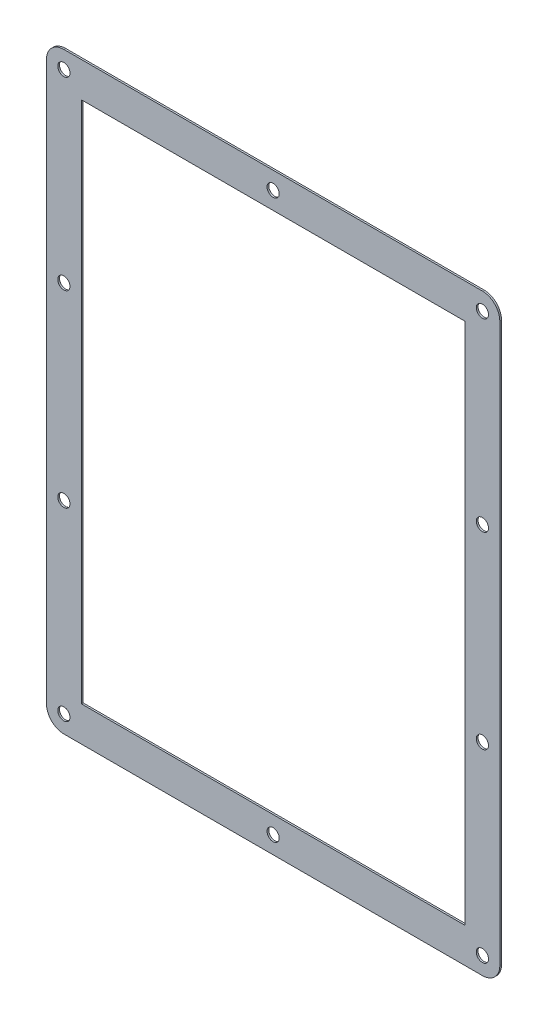
ISO-10303-21;
HEADER;
FILE_DESCRIPTION(('STEP AP214'),'2;1');
FILE_NAME('part.step','',(''),(''),'','','');
FILE_SCHEMA(('AUTOMOTIVE_DESIGN { 1 0 10303 214 1 1 1 1 }'));
ENDSEC;
DATA;
#1=APPLICATION_CONTEXT('core data for automotive mechanical design processes');
#2=APPLICATION_PROTOCOL_DEFINITION('international standard','automotive_design',2000,#1);
#3=PRODUCT_CONTEXT('',#1,'mechanical');
#4=PRODUCT('Part','Part','',(#3));
#5=PRODUCT_RELATED_PRODUCT_CATEGORY('part','',(#4));
#6=PRODUCT_DEFINITION_FORMATION('','',#4);
#7=PRODUCT_DEFINITION_CONTEXT('part definition',#1,'design');
#8=PRODUCT_DEFINITION('design','',#6,#7);
#9=PRODUCT_DEFINITION_SHAPE('','',#8);
#10=(LENGTH_UNIT() NAMED_UNIT(*) SI_UNIT(.MILLI.,.METRE.));
#11=(NAMED_UNIT(*) PLANE_ANGLE_UNIT() SI_UNIT($,.RADIAN.));
#12=(NAMED_UNIT(*) SI_UNIT($,.STERADIAN.) SOLID_ANGLE_UNIT());
#13=UNCERTAINTY_MEASURE_WITH_UNIT(LENGTH_MEASURE(1.E-05),#10,'distance_accuracy_value','');
#14=(GEOMETRIC_REPRESENTATION_CONTEXT(3) GLOBAL_UNCERTAINTY_ASSIGNED_CONTEXT((#13)) GLOBAL_UNIT_ASSIGNED_CONTEXT((#10,
#11,#12)) REPRESENTATION_CONTEXT('',''));
#15=CARTESIAN_POINT('',(0.,0.,0.));
#16=DIRECTION('',(0.,0.,1.));
#17=DIRECTION('',(1.,0.,0.));
#18=AXIS2_PLACEMENT_3D('',#15,#16,#17);
#19=CARTESIAN_POINT('',(60.,-80.,0.5));
#20=DIRECTION('',(0.,0.,1.));
#21=DIRECTION('',(1.,0.,0.));
#22=AXIS2_PLACEMENT_3D('',#19,#20,#21);
#23=PLANE('',#22);
#24=CARTESIAN_POINT('',(-60.,27.,0.5));
#25=DIRECTION('',(0.,0.,1.));
#26=DIRECTION('',(1.,0.,0.));
#27=AXIS2_PLACEMENT_3D('',#24,#25,#26);
#28=CIRCLE('',#27,1.74999999999998);
#29=CARTESIAN_POINT('',(-58.25,27.,0.5));
#30=VERTEX_POINT('',#29);
#31=EDGE_CURVE('E347',#30,#30,#28,.T.);
#32=ORIENTED_EDGE('',*,*,#31,.F.);
#33=EDGE_LOOP('',(#32));
#34=FACE_BOUND('',#33,.T.);
#35=CARTESIAN_POINT('',(60.,80.,0.5));
#36=DIRECTION('',(0.,0.,1.));
#37=DIRECTION('',(-1.,0.,0.));
#38=AXIS2_PLACEMENT_3D('',#35,#36,#37);
#39=CIRCLE('',#38,1.75000000000004);
#40=CARTESIAN_POINT('',(58.25,80.,0.5));
#41=VERTEX_POINT('',#40);
#42=EDGE_CURVE('E359',#41,#41,#39,.T.);
#43=ORIENTED_EDGE('',*,*,#42,.F.);
#44=EDGE_LOOP('',(#43));
#45=FACE_BOUND('',#44,.T.);
#46=CARTESIAN_POINT('',(0.,-79.9999999999999,0.5));
#47=DIRECTION('',(0.,0.,1.));
#48=DIRECTION('',(1.,0.,0.));
#49=AXIS2_PLACEMENT_3D('',#46,#47,#48);
#50=CIRCLE('',#49,1.75000000000001);
#51=CARTESIAN_POINT('',(1.75000000000001,-79.9999999999999,0.5));
#52=VERTEX_POINT('',#51);
#53=EDGE_CURVE('E371',#52,#52,#50,.T.);
#54=ORIENTED_EDGE('',*,*,#53,.F.);
#55=EDGE_LOOP('',(#54));
#56=FACE_BOUND('',#55,.T.);
#57=CARTESIAN_POINT('',(-60.,-27.,0.5));
#58=DIRECTION('',(0.,0.,1.));
#59=DIRECTION('',(-1.,0.,0.));
#60=AXIS2_PLACEMENT_3D('',#57,#58,#59);
#61=CIRCLE('',#60,1.74999999999998);
#62=CARTESIAN_POINT('',(-61.75,-27.,0.5));
#63=VERTEX_POINT('',#62);
#64=EDGE_CURVE('E383',#63,#63,#61,.T.);
#65=ORIENTED_EDGE('',*,*,#64,.F.);
#66=EDGE_LOOP('',(#65));
#67=FACE_BOUND('',#66,.T.);
#68=CARTESIAN_POINT('',(60.,-27.,0.5));
#69=DIRECTION('',(0.,0.,1.));
#70=DIRECTION('',(1.,0.,0.));
#71=AXIS2_PLACEMENT_3D('',#68,#69,#70);
#72=CIRCLE('',#71,1.75000000000004);
#73=CARTESIAN_POINT('',(61.75,-27.,0.5));
#74=VERTEX_POINT('',#73);
#75=EDGE_CURVE('E155',#74,#74,#72,.T.);
#76=ORIENTED_EDGE('',*,*,#75,.F.);
#77=EDGE_LOOP('',(#76));
#78=FACE_BOUND('',#77,.T.);
#79=CARTESIAN_POINT('',(60.,-80.,0.5));
#80=DIRECTION('',(0.,0.,1.));
#81=DIRECTION('',(1.,0.,0.));
#82=AXIS2_PLACEMENT_3D('',#79,#80,#81);
#83=CIRCLE('',#82,5.00000000000002);
#84=CARTESIAN_POINT('',(60.,-85.,0.5));
#85=VERTEX_POINT('',#84);
#86=CARTESIAN_POINT('',(65.,-80.,0.5));
#87=VERTEX_POINT('',#86);
#88=EDGE_CURVE('E165',#85,#87,#83,.T.);
#89=ORIENTED_EDGE('',*,*,#88,.T.);
#90=DIRECTION('',(0.,1.,0.));
#91=VECTOR('',#90,1.);
#92=CARTESIAN_POINT('',(65.,-80.,0.5));
#93=LINE('',#92,#91);
#94=CARTESIAN_POINT('',(65.,79.9999999999999,0.5));
#95=VERTEX_POINT('',#94);
#96=EDGE_CURVE('E168',#87,#95,#93,.T.);
#97=ORIENTED_EDGE('',*,*,#96,.T.);
#98=CARTESIAN_POINT('',(60.,79.9999999999999,0.5));
#99=DIRECTION('',(0.,0.,1.));
#100=DIRECTION('',(1.,0.,0.));
#101=AXIS2_PLACEMENT_3D('',#98,#99,#100);
#102=CIRCLE('',#101,5.00000000000002);
#103=CARTESIAN_POINT('',(60.,85.,0.5));
#104=VERTEX_POINT('',#103);
#105=EDGE_CURVE('E171',#95,#104,#102,.T.);
#106=ORIENTED_EDGE('',*,*,#105,.T.);
#107=DIRECTION('',(-1.,0.,0.));
#108=VECTOR('',#107,1.);
#109=CARTESIAN_POINT('',(60.,85.,0.5));
#110=LINE('',#109,#108);
#111=CARTESIAN_POINT('',(-60.0000000000001,85.,0.5));
#112=VERTEX_POINT('',#111);
#113=EDGE_CURVE('E173',#104,#112,#110,.T.);
#114=ORIENTED_EDGE('',*,*,#113,.T.);
#115=CARTESIAN_POINT('',(-60.0000000000001,79.9999999999999,0.5));
#116=DIRECTION('',(0.,0.,1.));
#117=DIRECTION('',(1.,0.,0.));
#118=AXIS2_PLACEMENT_3D('',#115,#116,#117);
#119=CIRCLE('',#118,5.00000000000001);
#120=CARTESIAN_POINT('',(-65.0000000000001,79.9999999999999,0.5));
#121=VERTEX_POINT('',#120);
#122=EDGE_CURVE('E175',#112,#121,#119,.T.);
#123=ORIENTED_EDGE('',*,*,#122,.T.);
#124=DIRECTION('',(0.,-1.,0.));
#125=VECTOR('',#124,1.);
#126=CARTESIAN_POINT('',(-65.0000000000001,-80.,0.5));
#127=LINE('',#126,#125);
#128=CARTESIAN_POINT('',(-65.0000000000001,-80.,0.5));
#129=VERTEX_POINT('',#128);
#130=EDGE_CURVE('E177',#121,#129,#127,.T.);
#131=ORIENTED_EDGE('',*,*,#130,.T.);
#132=CARTESIAN_POINT('',(-60.0000000000001,-80.,0.5));
#133=DIRECTION('',(0.,0.,1.));
#134=DIRECTION('',(-1.,0.,0.));
#135=AXIS2_PLACEMENT_3D('',#132,#133,#134);
#136=CIRCLE('',#135,5.);
#137=CARTESIAN_POINT('',(-60.0000000000001,-85.,0.5));
#138=VERTEX_POINT('',#137);
#139=EDGE_CURVE('E179',#129,#138,#136,.T.);
#140=ORIENTED_EDGE('',*,*,#139,.T.);
#141=DIRECTION('',(1.,0.,0.));
#142=VECTOR('',#141,1.);
#143=CARTESIAN_POINT('',(60.,-85.,0.5));
#144=LINE('',#143,#142);
#145=EDGE_CURVE('E181',#138,#85,#144,.T.);
#146=ORIENTED_EDGE('',*,*,#145,.T.);
#147=EDGE_LOOP('',(#89,#97,#106,#114,#123,#131,#140,#146));
#148=FACE_BOUND('',#147,.T.);
#149=DIRECTION('',(0.,1.,0.));
#150=VECTOR('',#149,1.);
#151=CARTESIAN_POINT('',(55.,-75.,0.5));
#152=LINE('',#151,#150);
#153=CARTESIAN_POINT('',(55.,-75.,0.5));
#154=VERTEX_POINT('',#153);
#155=CARTESIAN_POINT('',(55.,75.,0.5));
#156=VERTEX_POINT('',#155);
#157=EDGE_CURVE('E134',#154,#156,#152,.T.);
#158=ORIENTED_EDGE('',*,*,#157,.F.);
#159=DIRECTION('',(1.,0.,0.));
#160=VECTOR('',#159,1.);
#161=CARTESIAN_POINT('',(55.,-75.,0.5));
#162=LINE('',#161,#160);
#163=CARTESIAN_POINT('',(-55.0000000000001,-75.,0.5));
#164=VERTEX_POINT('',#163);
#165=EDGE_CURVE('E126',#164,#154,#162,.T.);
#166=ORIENTED_EDGE('',*,*,#165,.F.);
#167=DIRECTION('',(0.,-1.,0.));
#168=VECTOR('',#167,1.);
#169=CARTESIAN_POINT('',(-55.0000000000001,-75.,0.5));
#170=LINE('',#169,#168);
#171=CARTESIAN_POINT('',(-55.0000000000001,75.,0.5));
#172=VERTEX_POINT('',#171);
#173=EDGE_CURVE('E149',#172,#164,#170,.T.);
#174=ORIENTED_EDGE('',*,*,#173,.F.);
#175=DIRECTION('',(-1.,0.,0.));
#176=VECTOR('',#175,1.);
#177=CARTESIAN_POINT('',(55.,75.,0.5));
#178=LINE('',#177,#176);
#179=EDGE_CURVE('E147',#156,#172,#178,.T.);
#180=ORIENTED_EDGE('',*,*,#179,.F.);
#181=EDGE_LOOP('',(#158,#166,#174,#180));
#182=FACE_BOUND('',#181,.T.);
#183=CARTESIAN_POINT('',(60.,-79.9999999999999,0.5));
#184=DIRECTION('',(0.,0.,1.));
#185=DIRECTION('',(1.,0.,0.));
#186=AXIS2_PLACEMENT_3D('',#183,#184,#185);
#187=CIRCLE('',#186,1.75000000000004);
#188=CARTESIAN_POINT('',(61.75,-79.9999999999999,0.5));
#189=VERTEX_POINT('',#188);
#190=EDGE_CURVE('E389',#189,#189,#187,.T.);
#191=ORIENTED_EDGE('',*,*,#190,.F.);
#192=EDGE_LOOP('',(#191));
#193=FACE_BOUND('',#192,.T.);
#194=CARTESIAN_POINT('',(-60.,-79.9999999999999,0.5));
#195=DIRECTION('',(0.,0.,1.));
#196=DIRECTION('',(-1.,0.,0.));
#197=AXIS2_PLACEMENT_3D('',#194,#195,#196);
#198=CIRCLE('',#197,1.74999999999998);
#199=CARTESIAN_POINT('',(-61.75,-79.9999999999999,0.5));
#200=VERTEX_POINT('',#199);
#201=EDGE_CURVE('E377',#200,#200,#198,.T.);
#202=ORIENTED_EDGE('',*,*,#201,.F.);
#203=EDGE_LOOP('',(#202));
#204=FACE_BOUND('',#203,.T.);
#205=CARTESIAN_POINT('',(60.,27.,0.5));
#206=DIRECTION('',(0.,0.,1.));
#207=DIRECTION('',(-1.,0.,0.));
#208=AXIS2_PLACEMENT_3D('',#205,#206,#207);
#209=CIRCLE('',#208,1.75000000000004);
#210=CARTESIAN_POINT('',(58.25,27.,0.5));
#211=VERTEX_POINT('',#210);
#212=EDGE_CURVE('E365',#211,#211,#209,.T.);
#213=ORIENTED_EDGE('',*,*,#212,.F.);
#214=EDGE_LOOP('',(#213));
#215=FACE_BOUND('',#214,.T.);
#216=CARTESIAN_POINT('',(0.,80.,0.5));
#217=DIRECTION('',(0.,0.,1.));
#218=DIRECTION('',(-1.,0.,0.));
#219=AXIS2_PLACEMENT_3D('',#216,#217,#218);
#220=CIRCLE('',#219,1.75000000000001);
#221=CARTESIAN_POINT('',(-1.75000000000001,80.,0.5));
#222=VERTEX_POINT('',#221);
#223=EDGE_CURVE('E353',#222,#222,#220,.T.);
#224=ORIENTED_EDGE('',*,*,#223,.F.);
#225=EDGE_LOOP('',(#224));
#226=FACE_BOUND('',#225,.T.);
#227=CARTESIAN_POINT('',(-60.,80.,0.5));
#228=DIRECTION('',(0.,0.,1.));
#229=DIRECTION('',(1.,0.,0.));
#230=AXIS2_PLACEMENT_3D('',#227,#228,#229);
#231=CIRCLE('',#230,1.74999999999998);
#232=CARTESIAN_POINT('',(-58.25,80.,0.5));
#233=VERTEX_POINT('',#232);
#234=EDGE_CURVE('E338',#233,#233,#231,.T.);
#235=ORIENTED_EDGE('',*,*,#234,.F.);
#236=EDGE_LOOP('',(#235));
#237=FACE_BOUND('',#236,.T.);
#238=ADVANCED_FACE('F37',(#34,#45,#56,#67,#78,#148,#182,#193,#204,#215,#226,#237),#23,.T.);
#239=CARTESIAN_POINT('',(60.,-80.,0.));
#240=DIRECTION('',(0.,0.,1.));
#241=DIRECTION('',(1.,0.,0.));
#242=AXIS2_PLACEMENT_3D('',#239,#240,#241);
#243=PLANE('',#242);
#244=CARTESIAN_POINT('',(60.,-80.,0.));
#245=DIRECTION('',(0.,0.,1.));
#246=DIRECTION('',(1.,0.,0.));
#247=AXIS2_PLACEMENT_3D('',#244,#245,#246);
#248=CIRCLE('',#247,5.00000000000002);
#249=CARTESIAN_POINT('',(60.,-85.,0.));
#250=VERTEX_POINT('',#249);
#251=CARTESIAN_POINT('',(65.,-80.,0.));
#252=VERTEX_POINT('',#251);
#253=EDGE_CURVE('E142',#250,#252,#248,.T.);
#254=ORIENTED_EDGE('',*,*,#253,.F.);
#255=DIRECTION('',(1.,0.,0.));
#256=VECTOR('',#255,1.);
#257=CARTESIAN_POINT('',(60.,-85.,0.));
#258=LINE('',#257,#256);
#259=CARTESIAN_POINT('',(-60.0000000000001,-85.,0.));
#260=VERTEX_POINT('',#259);
#261=EDGE_CURVE('E169',#260,#250,#258,.T.);
#262=ORIENTED_EDGE('',*,*,#261,.F.);
#263=CARTESIAN_POINT('',(-60.0000000000001,-80.,0.));
#264=DIRECTION('',(0.,0.,1.));
#265=DIRECTION('',(-1.,0.,0.));
#266=AXIS2_PLACEMENT_3D('',#263,#264,#265);
#267=CIRCLE('',#266,5.);
#268=CARTESIAN_POINT('',(-65.0000000000001,-80.,0.));
#269=VERTEX_POINT('',#268);
#270=EDGE_CURVE('E196',#269,#260,#267,.T.);
#271=ORIENTED_EDGE('',*,*,#270,.F.);
#272=DIRECTION('',(0.,-1.,0.));
#273=VECTOR('',#272,1.);
#274=CARTESIAN_POINT('',(-65.0000000000001,-80.,0.));
#275=LINE('',#274,#273);
#276=CARTESIAN_POINT('',(-65.0000000000001,79.9999999999999,0.));
#277=VERTEX_POINT('',#276);
#278=EDGE_CURVE('E194',#277,#269,#275,.T.);
#279=ORIENTED_EDGE('',*,*,#278,.F.);
#280=CARTESIAN_POINT('',(-60.0000000000001,79.9999999999999,0.));
#281=DIRECTION('',(0.,0.,1.));
#282=DIRECTION('',(1.,0.,0.));
#283=AXIS2_PLACEMENT_3D('',#280,#281,#282);
#284=CIRCLE('',#283,5.00000000000001);
#285=CARTESIAN_POINT('',(-60.0000000000001,85.,0.));
#286=VERTEX_POINT('',#285);
#287=EDGE_CURVE('E192',#286,#277,#284,.T.);
#288=ORIENTED_EDGE('',*,*,#287,.F.);
#289=DIRECTION('',(-1.,0.,0.));
#290=VECTOR('',#289,1.);
#291=CARTESIAN_POINT('',(60.,85.,0.));
#292=LINE('',#291,#290);
#293=CARTESIAN_POINT('',(60.,85.,0.));
#294=VERTEX_POINT('',#293);
#295=EDGE_CURVE('E190',#294,#286,#292,.T.);
#296=ORIENTED_EDGE('',*,*,#295,.F.);
#297=CARTESIAN_POINT('',(60.,79.9999999999999,0.));
#298=DIRECTION('',(0.,0.,1.));
#299=DIRECTION('',(1.,0.,0.));
#300=AXIS2_PLACEMENT_3D('',#297,#298,#299);
#301=CIRCLE('',#300,5.00000000000002);
#302=CARTESIAN_POINT('',(65.,79.9999999999999,0.));
#303=VERTEX_POINT('',#302);
#304=EDGE_CURVE('E188',#303,#294,#301,.T.);
#305=ORIENTED_EDGE('',*,*,#304,.F.);
#306=DIRECTION('',(0.,1.,0.));
#307=VECTOR('',#306,1.);
#308=CARTESIAN_POINT('',(65.,-80.,0.));
#309=LINE('',#308,#307);
#310=EDGE_CURVE('E186',#252,#303,#309,.T.);
#311=ORIENTED_EDGE('',*,*,#310,.F.);
#312=EDGE_LOOP('',(#254,#262,#271,#279,#288,#296,#305,#311));
#313=FACE_BOUND('',#312,.T.);
#314=DIRECTION('',(1.,0.,0.));
#315=VECTOR('',#314,1.);
#316=CARTESIAN_POINT('',(55.,-75.,0.));
#317=LINE('',#316,#315);
#318=CARTESIAN_POINT('',(-55.0000000000001,-75.,0.));
#319=VERTEX_POINT('',#318);
#320=CARTESIAN_POINT('',(55.,-75.,0.));
#321=VERTEX_POINT('',#320);
#322=EDGE_CURVE('E60',#319,#321,#317,.T.);
#323=ORIENTED_EDGE('',*,*,#322,.T.);
#324=DIRECTION('',(0.,1.,0.));
#325=VECTOR('',#324,1.);
#326=CARTESIAN_POINT('',(55.,-75.,0.));
#327=LINE('',#326,#325);
#328=CARTESIAN_POINT('',(55.,75.,0.));
#329=VERTEX_POINT('',#328);
#330=EDGE_CURVE('E141',#321,#329,#327,.T.);
#331=ORIENTED_EDGE('',*,*,#330,.T.);
#332=DIRECTION('',(-1.,0.,0.));
#333=VECTOR('',#332,1.);
#334=CARTESIAN_POINT('',(55.,75.,0.));
#335=LINE('',#334,#333);
#336=CARTESIAN_POINT('',(-55.0000000000001,75.,0.));
#337=VERTEX_POINT('',#336);
#338=EDGE_CURVE('E157',#329,#337,#335,.T.);
#339=ORIENTED_EDGE('',*,*,#338,.T.);
#340=DIRECTION('',(0.,-1.,0.));
#341=VECTOR('',#340,1.);
#342=CARTESIAN_POINT('',(-55.0000000000001,-75.,0.));
#343=LINE('',#342,#341);
#344=EDGE_CURVE('E135',#337,#319,#343,.T.);
#345=ORIENTED_EDGE('',*,*,#344,.T.);
#346=EDGE_LOOP('',(#323,#331,#339,#345));
#347=FACE_BOUND('',#346,.T.);
#348=CARTESIAN_POINT('',(60.,-27.,0.));
#349=DIRECTION('',(0.,0.,1.));
#350=DIRECTION('',(1.,0.,0.));
#351=AXIS2_PLACEMENT_3D('',#348,#349,#350);
#352=CIRCLE('',#351,1.75000000000004);
#353=CARTESIAN_POINT('',(61.75,-27.,0.));
#354=VERTEX_POINT('',#353);
#355=EDGE_CURVE('E392',#354,#354,#352,.T.);
#356=ORIENTED_EDGE('',*,*,#355,.T.);
#357=EDGE_LOOP('',(#356));
#358=FACE_BOUND('',#357,.T.);
#359=CARTESIAN_POINT('',(60.,-79.9999999999999,0.));
#360=DIRECTION('',(0.,0.,1.));
#361=DIRECTION('',(1.,0.,0.));
#362=AXIS2_PLACEMENT_3D('',#359,#360,#361);
#363=CIRCLE('',#362,1.75000000000004);
#364=CARTESIAN_POINT('',(61.75,-79.9999999999999,0.));
#365=VERTEX_POINT('',#364);
#366=EDGE_CURVE('E386',#365,#365,#363,.T.);
#367=ORIENTED_EDGE('',*,*,#366,.T.);
#368=EDGE_LOOP('',(#367));
#369=FACE_BOUND('',#368,.T.);
#370=CARTESIAN_POINT('',(-60.,-27.,0.));
#371=DIRECTION('',(0.,0.,1.));
#372=DIRECTION('',(-1.,0.,0.));
#373=AXIS2_PLACEMENT_3D('',#370,#371,#372);
#374=CIRCLE('',#373,1.74999999999998);
#375=CARTESIAN_POINT('',(-61.75,-27.,0.));
#376=VERTEX_POINT('',#375);
#377=EDGE_CURVE('E380',#376,#376,#374,.T.);
#378=ORIENTED_EDGE('',*,*,#377,.T.);
#379=EDGE_LOOP('',(#378));
#380=FACE_BOUND('',#379,.T.);
#381=CARTESIAN_POINT('',(-60.,-79.9999999999999,0.));
#382=DIRECTION('',(0.,0.,1.));
#383=DIRECTION('',(-1.,0.,0.));
#384=AXIS2_PLACEMENT_3D('',#381,#382,#383);
#385=CIRCLE('',#384,1.74999999999998);
#386=CARTESIAN_POINT('',(-61.75,-79.9999999999999,0.));
#387=VERTEX_POINT('',#386);
#388=EDGE_CURVE('E374',#387,#387,#385,.T.);
#389=ORIENTED_EDGE('',*,*,#388,.T.);
#390=EDGE_LOOP('',(#389));
#391=FACE_BOUND('',#390,.T.);
#392=CARTESIAN_POINT('',(0.,-79.9999999999999,0.));
#393=DIRECTION('',(0.,0.,1.));
#394=DIRECTION('',(1.,0.,0.));
#395=AXIS2_PLACEMENT_3D('',#392,#393,#394);
#396=CIRCLE('',#395,1.75000000000001);
#397=CARTESIAN_POINT('',(1.75000000000001,-79.9999999999999,0.));
#398=VERTEX_POINT('',#397);
#399=EDGE_CURVE('E368',#398,#398,#396,.T.);
#400=ORIENTED_EDGE('',*,*,#399,.T.);
#401=EDGE_LOOP('',(#400));
#402=FACE_BOUND('',#401,.T.);
#403=CARTESIAN_POINT('',(60.,27.,0.));
#404=DIRECTION('',(0.,0.,1.));
#405=DIRECTION('',(-1.,0.,0.));
#406=AXIS2_PLACEMENT_3D('',#403,#404,#405);
#407=CIRCLE('',#406,1.75000000000004);
#408=CARTESIAN_POINT('',(58.25,27.,0.));
#409=VERTEX_POINT('',#408);
#410=EDGE_CURVE('E362',#409,#409,#407,.T.);
#411=ORIENTED_EDGE('',*,*,#410,.T.);
#412=EDGE_LOOP('',(#411));
#413=FACE_BOUND('',#412,.T.);
#414=CARTESIAN_POINT('',(60.,80.,0.));
#415=DIRECTION('',(0.,0.,1.));
#416=DIRECTION('',(-1.,0.,0.));
#417=AXIS2_PLACEMENT_3D('',#414,#415,#416);
#418=CIRCLE('',#417,1.75000000000004);
#419=CARTESIAN_POINT('',(58.25,80.,0.));
#420=VERTEX_POINT('',#419);
#421=EDGE_CURVE('E356',#420,#420,#418,.T.);
#422=ORIENTED_EDGE('',*,*,#421,.T.);
#423=EDGE_LOOP('',(#422));
#424=FACE_BOUND('',#423,.T.);
#425=CARTESIAN_POINT('',(0.,80.,0.));
#426=DIRECTION('',(0.,0.,1.));
#427=DIRECTION('',(-1.,0.,0.));
#428=AXIS2_PLACEMENT_3D('',#425,#426,#427);
#429=CIRCLE('',#428,1.75000000000001);
#430=CARTESIAN_POINT('',(-1.75000000000001,80.,0.));
#431=VERTEX_POINT('',#430);
#432=EDGE_CURVE('E350',#431,#431,#429,.T.);
#433=ORIENTED_EDGE('',*,*,#432,.T.);
#434=EDGE_LOOP('',(#433));
#435=FACE_BOUND('',#434,.T.);
#436=CARTESIAN_POINT('',(-60.,27.,0.));
#437=DIRECTION('',(0.,0.,1.));
#438=DIRECTION('',(1.,0.,0.));
#439=AXIS2_PLACEMENT_3D('',#436,#437,#438);
#440=CIRCLE('',#439,1.74999999999998);
#441=CARTESIAN_POINT('',(-58.25,27.,0.));
#442=VERTEX_POINT('',#441);
#443=EDGE_CURVE('E344',#442,#442,#440,.T.);
#444=ORIENTED_EDGE('',*,*,#443,.T.);
#445=EDGE_LOOP('',(#444));
#446=FACE_BOUND('',#445,.T.);
#447=CARTESIAN_POINT('',(-60.,80.,0.));
#448=DIRECTION('',(0.,0.,1.));
#449=DIRECTION('',(1.,0.,0.));
#450=AXIS2_PLACEMENT_3D('',#447,#448,#449);
#451=CIRCLE('',#450,1.74999999999998);
#452=CARTESIAN_POINT('',(-58.25,80.,0.));
#453=VERTEX_POINT('',#452);
#454=EDGE_CURVE('E341',#453,#453,#451,.T.);
#455=ORIENTED_EDGE('',*,*,#454,.T.);
#456=EDGE_LOOP('',(#455));
#457=FACE_BOUND('',#456,.T.);
#458=ADVANCED_FACE('F226',(#313,#347,#358,#369,#380,#391,#402,#413,#424,#435,#446,#457),#243,.F.);
#459=CARTESIAN_POINT('',(60.,-80.,0.5));
#460=DIRECTION('',(0.,0.,-1.));
#461=DIRECTION('',(-1.,0.,0.));
#462=AXIS2_PLACEMENT_3D('',#459,#460,#461);
#463=CYLINDRICAL_SURFACE('',#462,5.00000000000002);
#464=ORIENTED_EDGE('',*,*,#253,.T.);
#465=DIRECTION('',(0.,0.,-1.));
#466=VECTOR('',#465,1.);
#467=CARTESIAN_POINT('',(65.,-80.,0.5));
#468=LINE('',#467,#466);
#469=EDGE_CURVE('E11',#87,#252,#468,.T.);
#470=ORIENTED_EDGE('',*,*,#469,.F.);
#471=ORIENTED_EDGE('',*,*,#88,.F.);
#472=DIRECTION('',(0.,0.,-1.));
#473=VECTOR('',#472,1.);
#474=CARTESIAN_POINT('',(60.,-85.,0.5));
#475=LINE('',#474,#473);
#476=EDGE_CURVE('E183',#85,#250,#475,.T.);
#477=ORIENTED_EDGE('',*,*,#476,.T.);
#478=EDGE_LOOP('',(#464,#470,#471,#477));
#479=FACE_BOUND('',#478,.T.);
#480=ADVANCED_FACE('F39',(#479),#463,.T.);
#481=CARTESIAN_POINT('',(65.,-80.,0.5));
#482=DIRECTION('',(-1.,0.,0.));
#483=DIRECTION('',(0.,0.,1.));
#484=AXIS2_PLACEMENT_3D('',#481,#482,#483);
#485=PLANE('',#484);
#486=ORIENTED_EDGE('',*,*,#310,.T.);
#487=DIRECTION('',(0.,0.,-1.));
#488=VECTOR('',#487,1.);
#489=CARTESIAN_POINT('',(65.,79.9999999999999,0.5));
#490=LINE('',#489,#488);
#491=EDGE_CURVE('E45',#95,#303,#490,.T.);
#492=ORIENTED_EDGE('',*,*,#491,.F.);
#493=ORIENTED_EDGE('',*,*,#96,.F.);
#494=ORIENTED_EDGE('',*,*,#469,.T.);
#495=EDGE_LOOP('',(#486,#492,#493,#494));
#496=FACE_BOUND('',#495,.T.);
#497=ADVANCED_FACE('F243',(#496),#485,.F.);
#498=CARTESIAN_POINT('',(60.,79.9999999999999,0.5));
#499=DIRECTION('',(0.,0.,-1.));
#500=DIRECTION('',(-1.,0.,0.));
#501=AXIS2_PLACEMENT_3D('',#498,#499,#500);
#502=CYLINDRICAL_SURFACE('',#501,5.00000000000002);
#503=ORIENTED_EDGE('',*,*,#304,.T.);
#504=DIRECTION('',(0.,0.,-1.));
#505=VECTOR('',#504,1.);
#506=CARTESIAN_POINT('',(60.,85.,0.5));
#507=LINE('',#506,#505);
#508=EDGE_CURVE('E213',#104,#294,#507,.T.);
#509=ORIENTED_EDGE('',*,*,#508,.F.);
#510=ORIENTED_EDGE('',*,*,#105,.F.);
#511=ORIENTED_EDGE('',*,*,#491,.T.);
#512=EDGE_LOOP('',(#503,#509,#510,#511));
#513=FACE_BOUND('',#512,.T.);
#514=ADVANCED_FACE('F220',(#513),#502,.T.);
#515=CARTESIAN_POINT('',(60.,85.,0.5));
#516=DIRECTION('',(0.,-1.,0.));
#517=DIRECTION('',(0.,0.,-1.));
#518=AXIS2_PLACEMENT_3D('',#515,#516,#517);
#519=PLANE('',#518);
#520=ORIENTED_EDGE('',*,*,#295,.T.);
#521=DIRECTION('',(0.,0.,-1.));
#522=VECTOR('',#521,1.);
#523=CARTESIAN_POINT('',(-60.0000000000001,85.,0.5));
#524=LINE('',#523,#522);
#525=EDGE_CURVE('E210',#112,#286,#524,.T.);
#526=ORIENTED_EDGE('',*,*,#525,.F.);
#527=ORIENTED_EDGE('',*,*,#113,.F.);
#528=ORIENTED_EDGE('',*,*,#508,.T.);
#529=EDGE_LOOP('',(#520,#526,#527,#528));
#530=FACE_BOUND('',#529,.T.);
#531=ADVANCED_FACE('F232',(#530),#519,.F.);
#532=CARTESIAN_POINT('',(-60.0000000000001,79.9999999999999,0.5));
#533=DIRECTION('',(0.,0.,-1.));
#534=DIRECTION('',(-1.,0.,0.));
#535=AXIS2_PLACEMENT_3D('',#532,#533,#534);
#536=CYLINDRICAL_SURFACE('',#535,5.00000000000001);
#537=ORIENTED_EDGE('',*,*,#287,.T.);
#538=DIRECTION('',(0.,0.,-1.));
#539=VECTOR('',#538,1.);
#540=CARTESIAN_POINT('',(-65.0000000000001,79.9999999999999,0.5));
#541=LINE('',#540,#539);
#542=EDGE_CURVE('E207',#121,#277,#541,.T.);
#543=ORIENTED_EDGE('',*,*,#542,.F.);
#544=ORIENTED_EDGE('',*,*,#122,.F.);
#545=ORIENTED_EDGE('',*,*,#525,.T.);
#546=EDGE_LOOP('',(#537,#543,#544,#545));
#547=FACE_BOUND('',#546,.T.);
#548=ADVANCED_FACE('F236',(#547),#536,.T.);
#549=CARTESIAN_POINT('',(-65.0000000000001,-80.,0.5));
#550=DIRECTION('',(1.,0.,0.));
#551=DIRECTION('',(0.,1.,0.));
#552=AXIS2_PLACEMENT_3D('',#549,#550,#551);
#553=PLANE('',#552);
#554=ORIENTED_EDGE('',*,*,#278,.T.);
#555=DIRECTION('',(0.,0.,-1.));
#556=VECTOR('',#555,1.);
#557=CARTESIAN_POINT('',(-65.0000000000001,-80.,0.5));
#558=LINE('',#557,#556);
#559=EDGE_CURVE('E204',#129,#269,#558,.T.);
#560=ORIENTED_EDGE('',*,*,#559,.F.);
#561=ORIENTED_EDGE('',*,*,#130,.F.);
#562=ORIENTED_EDGE('',*,*,#542,.T.);
#563=EDGE_LOOP('',(#554,#560,#561,#562));
#564=FACE_BOUND('',#563,.T.);
#565=ADVANCED_FACE('F256',(#564),#553,.F.);
#566=CARTESIAN_POINT('',(-60.0000000000001,-80.,0.5));
#567=DIRECTION('',(0.,0.,-1.));
#568=DIRECTION('',(-1.,0.,0.));
#569=AXIS2_PLACEMENT_3D('',#566,#567,#568);
#570=CYLINDRICAL_SURFACE('',#569,5.);
#571=ORIENTED_EDGE('',*,*,#270,.T.);
#572=DIRECTION('',(0.,0.,-1.));
#573=VECTOR('',#572,1.);
#574=CARTESIAN_POINT('',(-60.0000000000001,-85.,0.5));
#575=LINE('',#574,#573);
#576=EDGE_CURVE('E201',#138,#260,#575,.T.);
#577=ORIENTED_EDGE('',*,*,#576,.F.);
#578=ORIENTED_EDGE('',*,*,#139,.F.);
#579=ORIENTED_EDGE('',*,*,#559,.T.);
#580=EDGE_LOOP('',(#571,#577,#578,#579));
#581=FACE_BOUND('',#580,.T.);
#582=ADVANCED_FACE('F254',(#581),#570,.T.);
#583=CARTESIAN_POINT('',(60.,-85.,0.5));
#584=DIRECTION('',(0.,1.,0.));
#585=DIRECTION('',(-1.,0.,0.));
#586=AXIS2_PLACEMENT_3D('',#583,#584,#585);
#587=PLANE('',#586);
#588=ORIENTED_EDGE('',*,*,#261,.T.);
#589=ORIENTED_EDGE('',*,*,#476,.F.);
#590=ORIENTED_EDGE('',*,*,#145,.F.);
#591=ORIENTED_EDGE('',*,*,#576,.T.);
#592=EDGE_LOOP('',(#588,#589,#590,#591));
#593=FACE_BOUND('',#592,.T.);
#594=ADVANCED_FACE('F249',(#593),#587,.F.);
#595=CARTESIAN_POINT('',(55.,-75.,0.5));
#596=DIRECTION('',(0.,1.,0.));
#597=DIRECTION('',(-1.,0.,0.));
#598=AXIS2_PLACEMENT_3D('',#595,#596,#597);
#599=PLANE('',#598);
#600=ORIENTED_EDGE('',*,*,#322,.F.);
#601=DIRECTION('',(0.,0.,-1.));
#602=VECTOR('',#601,1.);
#603=CARTESIAN_POINT('',(-55.0000000000001,-75.,0.5));
#604=LINE('',#603,#602);
#605=EDGE_CURVE('E130',#164,#319,#604,.T.);
#606=ORIENTED_EDGE('',*,*,#605,.F.);
#607=ORIENTED_EDGE('',*,*,#165,.T.);
#608=DIRECTION('',(0.,0.,-1.));
#609=VECTOR('',#608,1.);
#610=CARTESIAN_POINT('',(55.,-75.,0.5));
#611=LINE('',#610,#609);
#612=EDGE_CURVE('E129',#154,#321,#611,.T.);
#613=ORIENTED_EDGE('',*,*,#612,.T.);
#614=EDGE_LOOP('',(#600,#606,#607,#613));
#615=FACE_BOUND('',#614,.T.);
#616=ADVANCED_FACE('F128',(#615),#599,.T.);
#617=CARTESIAN_POINT('',(55.,-75.,0.5));
#618=DIRECTION('',(-1.,0.,0.));
#619=DIRECTION('',(0.,0.,1.));
#620=AXIS2_PLACEMENT_3D('',#617,#618,#619);
#621=PLANE('',#620);
#622=ORIENTED_EDGE('',*,*,#330,.F.);
#623=ORIENTED_EDGE('',*,*,#612,.F.);
#624=ORIENTED_EDGE('',*,*,#157,.T.);
#625=DIRECTION('',(0.,0.,-1.));
#626=VECTOR('',#625,1.);
#627=CARTESIAN_POINT('',(55.,75.,0.5));
#628=LINE('',#627,#626);
#629=EDGE_CURVE('E143',#156,#329,#628,.T.);
#630=ORIENTED_EDGE('',*,*,#629,.T.);
#631=EDGE_LOOP('',(#622,#623,#624,#630));
#632=FACE_BOUND('',#631,.T.);
#633=ADVANCED_FACE('F138',(#632),#621,.T.);
#634=CARTESIAN_POINT('',(55.,75.,0.5));
#635=DIRECTION('',(0.,-1.,0.));
#636=DIRECTION('',(0.,0.,-1.));
#637=AXIS2_PLACEMENT_3D('',#634,#635,#636);
#638=PLANE('',#637);
#639=ORIENTED_EDGE('',*,*,#338,.F.);
#640=ORIENTED_EDGE('',*,*,#629,.F.);
#641=ORIENTED_EDGE('',*,*,#179,.T.);
#642=DIRECTION('',(0.,0.,-1.));
#643=VECTOR('',#642,1.);
#644=CARTESIAN_POINT('',(-55.0000000000001,75.,0.5));
#645=LINE('',#644,#643);
#646=EDGE_CURVE('E52',#172,#337,#645,.T.);
#647=ORIENTED_EDGE('',*,*,#646,.T.);
#648=EDGE_LOOP('',(#639,#640,#641,#647));
#649=FACE_BOUND('',#648,.T.);
#650=ADVANCED_FACE('F284',(#649),#638,.T.);
#651=CARTESIAN_POINT('',(-55.0000000000001,-75.,0.5));
#652=DIRECTION('',(1.,0.,0.));
#653=DIRECTION('',(0.,1.,0.));
#654=AXIS2_PLACEMENT_3D('',#651,#652,#653);
#655=PLANE('',#654);
#656=ORIENTED_EDGE('',*,*,#344,.F.);
#657=ORIENTED_EDGE('',*,*,#646,.F.);
#658=ORIENTED_EDGE('',*,*,#173,.T.);
#659=ORIENTED_EDGE('',*,*,#605,.T.);
#660=EDGE_LOOP('',(#656,#657,#658,#659));
#661=FACE_BOUND('',#660,.T.);
#662=ADVANCED_FACE('F288',(#661),#655,.T.);
#663=CARTESIAN_POINT('',(60.,-27.,0.5));
#664=DIRECTION('',(0.,0.,-1.));
#665=DIRECTION('',(-1.,0.,0.));
#666=AXIS2_PLACEMENT_3D('',#663,#664,#665);
#667=CYLINDRICAL_SURFACE('',#666,1.75000000000004);
#668=ORIENTED_EDGE('',*,*,#75,.T.);
#669=EDGE_LOOP('',(#668));
#670=FACE_BOUND('',#669,.T.);
#671=ORIENTED_EDGE('',*,*,#355,.F.);
#672=EDGE_LOOP('',(#671));
#673=FACE_BOUND('',#672,.T.);
#674=ADVANCED_FACE('F294',(#670,#673),#667,.F.);
#675=CARTESIAN_POINT('',(60.,-79.9999999999999,0.5));
#676=DIRECTION('',(0.,0.,-1.));
#677=DIRECTION('',(-1.,0.,0.));
#678=AXIS2_PLACEMENT_3D('',#675,#676,#677);
#679=CYLINDRICAL_SURFACE('',#678,1.75000000000004);
#680=ORIENTED_EDGE('',*,*,#190,.T.);
#681=EDGE_LOOP('',(#680));
#682=FACE_BOUND('',#681,.T.);
#683=ORIENTED_EDGE('',*,*,#366,.F.);
#684=EDGE_LOOP('',(#683));
#685=FACE_BOUND('',#684,.T.);
#686=ADVANCED_FACE('F297',(#682,#685),#679,.F.);
#687=CARTESIAN_POINT('',(-60.,-27.,0.5));
#688=DIRECTION('',(0.,0.,-1.));
#689=DIRECTION('',(-1.,0.,0.));
#690=AXIS2_PLACEMENT_3D('',#687,#688,#689);
#691=CYLINDRICAL_SURFACE('',#690,1.74999999999998);
#692=ORIENTED_EDGE('',*,*,#64,.T.);
#693=EDGE_LOOP('',(#692));
#694=FACE_BOUND('',#693,.T.);
#695=ORIENTED_EDGE('',*,*,#377,.F.);
#696=EDGE_LOOP('',(#695));
#697=FACE_BOUND('',#696,.T.);
#698=ADVANCED_FACE('F301',(#694,#697),#691,.F.);
#699=CARTESIAN_POINT('',(-60.,-79.9999999999999,0.5));
#700=DIRECTION('',(0.,0.,-1.));
#701=DIRECTION('',(-1.,0.,0.));
#702=AXIS2_PLACEMENT_3D('',#699,#700,#701);
#703=CYLINDRICAL_SURFACE('',#702,1.74999999999998);
#704=ORIENTED_EDGE('',*,*,#201,.T.);
#705=EDGE_LOOP('',(#704));
#706=FACE_BOUND('',#705,.T.);
#707=ORIENTED_EDGE('',*,*,#388,.F.);
#708=EDGE_LOOP('',(#707));
#709=FACE_BOUND('',#708,.T.);
#710=ADVANCED_FACE('F305',(#706,#709),#703,.F.);
#711=CARTESIAN_POINT('',(0.,-79.9999999999999,0.5));
#712=DIRECTION('',(0.,0.,-1.));
#713=DIRECTION('',(-1.,0.,0.));
#714=AXIS2_PLACEMENT_3D('',#711,#712,#713);
#715=CYLINDRICAL_SURFACE('',#714,1.75000000000001);
#716=ORIENTED_EDGE('',*,*,#53,.T.);
#717=EDGE_LOOP('',(#716));
#718=FACE_BOUND('',#717,.T.);
#719=ORIENTED_EDGE('',*,*,#399,.F.);
#720=EDGE_LOOP('',(#719));
#721=FACE_BOUND('',#720,.T.);
#722=ADVANCED_FACE('F309',(#718,#721),#715,.F.);
#723=CARTESIAN_POINT('',(60.,27.,0.5));
#724=DIRECTION('',(0.,0.,-1.));
#725=DIRECTION('',(-1.,0.,0.));
#726=AXIS2_PLACEMENT_3D('',#723,#724,#725);
#727=CYLINDRICAL_SURFACE('',#726,1.75000000000004);
#728=ORIENTED_EDGE('',*,*,#212,.T.);
#729=EDGE_LOOP('',(#728));
#730=FACE_BOUND('',#729,.T.);
#731=ORIENTED_EDGE('',*,*,#410,.F.);
#732=EDGE_LOOP('',(#731));
#733=FACE_BOUND('',#732,.T.);
#734=ADVANCED_FACE('F313',(#730,#733),#727,.F.);
#735=CARTESIAN_POINT('',(60.,80.,0.5));
#736=DIRECTION('',(0.,0.,-1.));
#737=DIRECTION('',(-1.,0.,0.));
#738=AXIS2_PLACEMENT_3D('',#735,#736,#737);
#739=CYLINDRICAL_SURFACE('',#738,1.75000000000004);
#740=ORIENTED_EDGE('',*,*,#42,.T.);
#741=EDGE_LOOP('',(#740));
#742=FACE_BOUND('',#741,.T.);
#743=ORIENTED_EDGE('',*,*,#421,.F.);
#744=EDGE_LOOP('',(#743));
#745=FACE_BOUND('',#744,.T.);
#746=ADVANCED_FACE('F317',(#742,#745),#739,.F.);
#747=CARTESIAN_POINT('',(0.,80.,0.5));
#748=DIRECTION('',(0.,0.,-1.));
#749=DIRECTION('',(-1.,0.,0.));
#750=AXIS2_PLACEMENT_3D('',#747,#748,#749);
#751=CYLINDRICAL_SURFACE('',#750,1.75000000000001);
#752=ORIENTED_EDGE('',*,*,#223,.T.);
#753=EDGE_LOOP('',(#752));
#754=FACE_BOUND('',#753,.T.);
#755=ORIENTED_EDGE('',*,*,#432,.F.);
#756=EDGE_LOOP('',(#755));
#757=FACE_BOUND('',#756,.T.);
#758=ADVANCED_FACE('F321',(#754,#757),#751,.F.);
#759=CARTESIAN_POINT('',(-60.,27.,0.5));
#760=DIRECTION('',(0.,0.,-1.));
#761=DIRECTION('',(-1.,0.,0.));
#762=AXIS2_PLACEMENT_3D('',#759,#760,#761);
#763=CYLINDRICAL_SURFACE('',#762,1.74999999999998);
#764=ORIENTED_EDGE('',*,*,#31,.T.);
#765=EDGE_LOOP('',(#764));
#766=FACE_BOUND('',#765,.T.);
#767=ORIENTED_EDGE('',*,*,#443,.F.);
#768=EDGE_LOOP('',(#767));
#769=FACE_BOUND('',#768,.T.);
#770=ADVANCED_FACE('F325',(#766,#769),#763,.F.);
#771=CARTESIAN_POINT('',(-60.,80.,0.5));
#772=DIRECTION('',(0.,0.,-1.));
#773=DIRECTION('',(-1.,0.,0.));
#774=AXIS2_PLACEMENT_3D('',#771,#772,#773);
#775=CYLINDRICAL_SURFACE('',#774,1.74999999999998);
#776=ORIENTED_EDGE('',*,*,#234,.T.);
#777=EDGE_LOOP('',(#776));
#778=FACE_BOUND('',#777,.T.);
#779=ORIENTED_EDGE('',*,*,#454,.F.);
#780=EDGE_LOOP('',(#779));
#781=FACE_BOUND('',#780,.T.);
#782=ADVANCED_FACE('F329',(#778,#781),#775,.F.);
#783=CLOSED_SHELL('',(#238,#458,#480,#497,#514,#531,#548,#565,#582,#594,#616,#633,#650,#662,
#674,#686,#698,#710,#722,#734,#746,#758,#770,#782));
#784=MANIFOLD_SOLID_BREP('B2',#783);
#785=ADVANCED_BREP_SHAPE_REPRESENTATION('',(#18,#784),#14);
#786=SHAPE_DEFINITION_REPRESENTATION(#9,#785);
ENDSEC;
END-ISO-10303-21;
